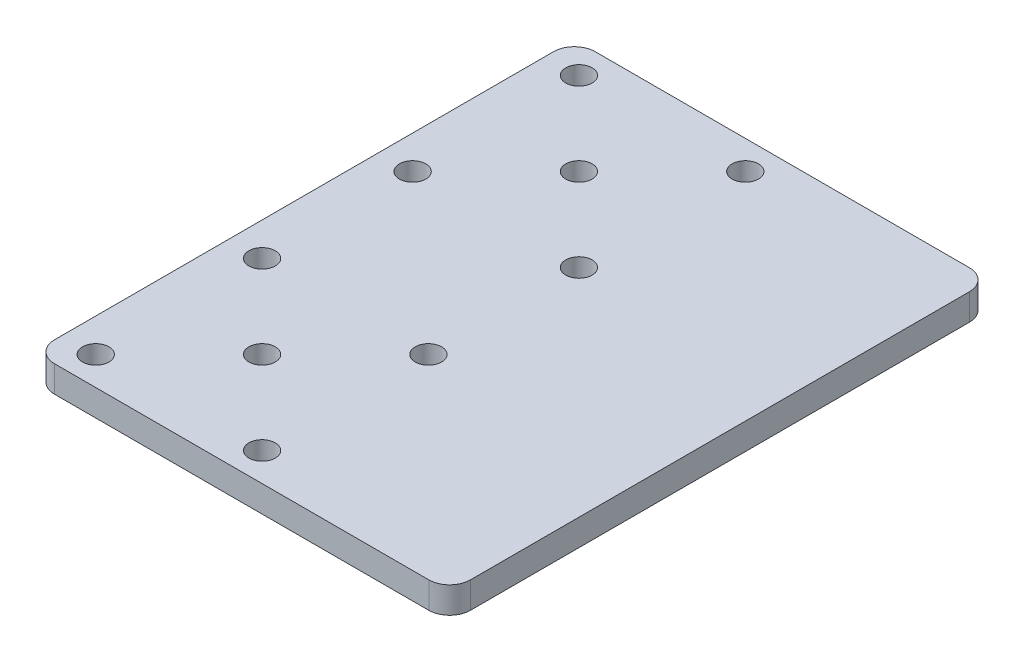
ISO-10303-21;
HEADER;
FILE_DESCRIPTION(('STEP AP214'),'2;1');
FILE_NAME('part.step','',(''),(''),'','','');
FILE_SCHEMA(('AUTOMOTIVE_DESIGN { 1 0 10303 214 1 1 1 1 }'));
ENDSEC;
DATA;
#1=APPLICATION_CONTEXT('core data for automotive mechanical design processes');
#2=APPLICATION_PROTOCOL_DEFINITION('international standard','automotive_design',2000,#1);
#3=PRODUCT_CONTEXT('',#1,'mechanical');
#4=PRODUCT('Part','Part','',(#3));
#5=PRODUCT_RELATED_PRODUCT_CATEGORY('part','',(#4));
#6=PRODUCT_DEFINITION_FORMATION('','',#4);
#7=PRODUCT_DEFINITION_CONTEXT('part definition',#1,'design');
#8=PRODUCT_DEFINITION('design','',#6,#7);
#9=PRODUCT_DEFINITION_SHAPE('','',#8);
#10=(LENGTH_UNIT() NAMED_UNIT(*) SI_UNIT(.MILLI.,.METRE.));
#11=(NAMED_UNIT(*) PLANE_ANGLE_UNIT() SI_UNIT($,.RADIAN.));
#12=(NAMED_UNIT(*) SI_UNIT($,.STERADIAN.) SOLID_ANGLE_UNIT());
#13=UNCERTAINTY_MEASURE_WITH_UNIT(LENGTH_MEASURE(1.E-05),#10,'distance_accuracy_value','');
#14=(GEOMETRIC_REPRESENTATION_CONTEXT(3) GLOBAL_UNCERTAINTY_ASSIGNED_CONTEXT((#13)) GLOBAL_UNIT_ASSIGNED_CONTEXT((#10,
#11,#12)) REPRESENTATION_CONTEXT('',''));
#15=CARTESIAN_POINT('',(0.,0.,0.));
#16=DIRECTION('',(0.,0.,1.));
#17=DIRECTION('',(1.,0.,0.));
#18=AXIS2_PLACEMENT_3D('',#15,#16,#17);
#19=CARTESIAN_POINT('',(-50.,6.35,65.));
#20=DIRECTION('',(0.,0.,-1.));
#21=DIRECTION('',(-1.,0.,0.));
#22=AXIS2_PLACEMENT_3D('',#19,#20,#21);
#23=PLANE('',#22);
#24=DIRECTION('',(1.,0.,0.));
#25=VECTOR('',#24,1.);
#26=CARTESIAN_POINT('',(-50.,6.35,65.));
#27=LINE('',#26,#25);
#28=CARTESIAN_POINT('',(-45.,6.35,65.));
#29=VERTEX_POINT('',#28);
#30=CARTESIAN_POINT('',(45.,6.35,65.));
#31=VERTEX_POINT('',#30);
#32=EDGE_CURVE('E128',#29,#31,#27,.T.);
#33=ORIENTED_EDGE('',*,*,#32,.F.);
#34=DIRECTION('',(0.,-1.,0.));
#35=VECTOR('',#34,1.);
#36=CARTESIAN_POINT('',(-45.,6.35,65.));
#37=LINE('',#36,#35);
#38=CARTESIAN_POINT('',(-45.,0.,65.));
#39=VERTEX_POINT('',#38);
#40=EDGE_CURVE('E11',#29,#39,#37,.T.);
#41=ORIENTED_EDGE('',*,*,#40,.T.);
#42=DIRECTION('',(1.,0.,0.));
#43=VECTOR('',#42,1.);
#44=CARTESIAN_POINT('',(-50.,0.,65.));
#45=LINE('',#44,#43);
#46=CARTESIAN_POINT('',(45.,0.,65.));
#47=VERTEX_POINT('',#46);
#48=EDGE_CURVE('E130',#39,#47,#45,.T.);
#49=ORIENTED_EDGE('',*,*,#48,.T.);
#50=DIRECTION('',(0.,-1.,0.));
#51=VECTOR('',#50,1.);
#52=CARTESIAN_POINT('',(45.,6.35,65.));
#53=LINE('',#52,#51);
#54=EDGE_CURVE('E41',#47,#31,#53,.F.);
#55=ORIENTED_EDGE('',*,*,#54,.T.);
#56=EDGE_LOOP('',(#33,#41,#49,#55));
#57=FACE_BOUND('',#56,.T.);
#58=ADVANCED_FACE('F33',(#57),#23,.F.);
#59=CARTESIAN_POINT('',(50.,6.35,65.));
#60=DIRECTION('',(-1.,0.,0.));
#61=DIRECTION('',(0.,0.,1.));
#62=AXIS2_PLACEMENT_3D('',#59,#60,#61);
#63=PLANE('',#62);
#64=DIRECTION('',(0.,0.,-1.));
#65=VECTOR('',#64,1.);
#66=CARTESIAN_POINT('',(50.,0.,65.));
#67=LINE('',#66,#65);
#68=CARTESIAN_POINT('',(50.,0.,60.));
#69=VERTEX_POINT('',#68);
#70=CARTESIAN_POINT('',(50.,0.,-60.));
#71=VERTEX_POINT('',#70);
#72=EDGE_CURVE('E126',#69,#71,#67,.T.);
#73=ORIENTED_EDGE('',*,*,#72,.T.);
#74=DIRECTION('',(0.,-1.,0.));
#75=VECTOR('',#74,1.);
#76=CARTESIAN_POINT('',(50.,6.35,-60.));
#77=LINE('',#76,#75);
#78=CARTESIAN_POINT('',(50.,6.35,-60.));
#79=VERTEX_POINT('',#78);
#80=EDGE_CURVE('E105',#71,#79,#77,.F.);
#81=ORIENTED_EDGE('',*,*,#80,.T.);
#82=DIRECTION('',(0.,0.,-1.));
#83=VECTOR('',#82,1.);
#84=CARTESIAN_POINT('',(50.,6.35,65.));
#85=LINE('',#84,#83);
#86=CARTESIAN_POINT('',(50.,6.35,60.));
#87=VERTEX_POINT('',#86);
#88=EDGE_CURVE('E166',#87,#79,#85,.T.);
#89=ORIENTED_EDGE('',*,*,#88,.F.);
#90=DIRECTION('',(0.,-1.,0.));
#91=VECTOR('',#90,1.);
#92=CARTESIAN_POINT('',(50.,6.35,60.));
#93=LINE('',#92,#91);
#94=EDGE_CURVE('E110',#87,#69,#93,.T.);
#95=ORIENTED_EDGE('',*,*,#94,.T.);
#96=EDGE_LOOP('',(#73,#81,#89,#95));
#97=FACE_BOUND('',#96,.T.);
#98=ADVANCED_FACE('F170',(#97),#63,.F.);
#99=CARTESIAN_POINT('',(-50.,6.35,-65.));
#100=DIRECTION('',(0.,0.,1.));
#101=DIRECTION('',(1.,0.,0.));
#102=AXIS2_PLACEMENT_3D('',#99,#100,#101);
#103=PLANE('',#102);
#104=DIRECTION('',(-1.,0.,0.));
#105=VECTOR('',#104,1.);
#106=CARTESIAN_POINT('',(-50.,6.35,-65.));
#107=LINE('',#106,#105);
#108=CARTESIAN_POINT('',(45.,6.35,-65.));
#109=VERTEX_POINT('',#108);
#110=CARTESIAN_POINT('',(-45.,6.35,-65.));
#111=VERTEX_POINT('',#110);
#112=EDGE_CURVE('E119',#109,#111,#107,.T.);
#113=ORIENTED_EDGE('',*,*,#112,.F.);
#114=DIRECTION('',(0.,-1.,0.));
#115=VECTOR('',#114,1.);
#116=CARTESIAN_POINT('',(45.,6.35,-65.));
#117=LINE('',#116,#115);
#118=CARTESIAN_POINT('',(45.,0.,-65.));
#119=VERTEX_POINT('',#118);
#120=EDGE_CURVE('E104',#109,#119,#117,.T.);
#121=ORIENTED_EDGE('',*,*,#120,.T.);
#122=DIRECTION('',(-1.,0.,0.));
#123=VECTOR('',#122,1.);
#124=CARTESIAN_POINT('',(-50.,0.,-65.));
#125=LINE('',#124,#123);
#126=CARTESIAN_POINT('',(-45.,0.,-65.));
#127=VERTEX_POINT('',#126);
#128=EDGE_CURVE('E117',#119,#127,#125,.T.);
#129=ORIENTED_EDGE('',*,*,#128,.T.);
#130=DIRECTION('',(0.,-1.,0.));
#131=VECTOR('',#130,1.);
#132=CARTESIAN_POINT('',(-45.,6.35,-65.));
#133=LINE('',#132,#131);
#134=EDGE_CURVE('E121',#127,#111,#133,.F.);
#135=ORIENTED_EDGE('',*,*,#134,.T.);
#136=EDGE_LOOP('',(#113,#121,#129,#135));
#137=FACE_BOUND('',#136,.T.);
#138=ADVANCED_FACE('F116',(#137),#103,.F.);
#139=CARTESIAN_POINT('',(-50.,6.35,65.));
#140=DIRECTION('',(1.,0.,0.));
#141=DIRECTION('',(0.,0.,-1.));
#142=AXIS2_PLACEMENT_3D('',#139,#140,#141);
#143=PLANE('',#142);
#144=DIRECTION('',(0.,0.,1.));
#145=VECTOR('',#144,1.);
#146=CARTESIAN_POINT('',(-50.,6.35,65.));
#147=LINE('',#146,#145);
#148=CARTESIAN_POINT('',(-50.,6.35,-60.));
#149=VERTEX_POINT('',#148);
#150=CARTESIAN_POINT('',(-50.,6.35,60.));
#151=VERTEX_POINT('',#150);
#152=EDGE_CURVE('E134',#149,#151,#147,.T.);
#153=ORIENTED_EDGE('',*,*,#152,.F.);
#154=DIRECTION('',(0.,-1.,0.));
#155=VECTOR('',#154,1.);
#156=CARTESIAN_POINT('',(-50.,6.35,-60.));
#157=LINE('',#156,#155);
#158=CARTESIAN_POINT('',(-50.,0.,-60.));
#159=VERTEX_POINT('',#158);
#160=EDGE_CURVE('E151',#149,#159,#157,.T.);
#161=ORIENTED_EDGE('',*,*,#160,.T.);
#162=DIRECTION('',(0.,0.,1.));
#163=VECTOR('',#162,1.);
#164=CARTESIAN_POINT('',(-50.,0.,65.));
#165=LINE('',#164,#163);
#166=CARTESIAN_POINT('',(-50.,0.,60.));
#167=VERTEX_POINT('',#166);
#168=EDGE_CURVE('E125',#159,#167,#165,.T.);
#169=ORIENTED_EDGE('',*,*,#168,.T.);
#170=DIRECTION('',(0.,-1.,0.));
#171=VECTOR('',#170,1.);
#172=CARTESIAN_POINT('',(-50.,6.35,60.));
#173=LINE('',#172,#171);
#174=EDGE_CURVE('E48',#167,#151,#173,.F.);
#175=ORIENTED_EDGE('',*,*,#174,.T.);
#176=EDGE_LOOP('',(#153,#161,#169,#175));
#177=FACE_BOUND('',#176,.T.);
#178=ADVANCED_FACE('F240',(#177),#143,.F.);
#179=CARTESIAN_POINT('',(0.,6.35,0.));
#180=DIRECTION('',(0.,1.,0.));
#181=DIRECTION('',(0.,0.,1.));
#182=AXIS2_PLACEMENT_3D('',#179,#180,#181);
#183=PLANE('',#182);
#184=CARTESIAN_POINT('',(-42.,6.35,-18.1));
#185=DIRECTION('',(0.,1.,0.));
#186=DIRECTION('',(0.,0.,1.));
#187=AXIS2_PLACEMENT_3D('',#184,#185,#186);
#188=CIRCLE('',#187,3.175);
#189=CARTESIAN_POINT('',(-42.,6.35,-14.925));
#190=VERTEX_POINT('',#189);
#191=EDGE_CURVE('E232',#190,#190,#188,.T.);
#192=ORIENTED_EDGE('',*,*,#191,.F.);
#193=EDGE_LOOP('',(#192));
#194=FACE_BOUND('',#193,.T.);
#195=CARTESIAN_POINT('',(-2.00000000000002,6.35,-18.1));
#196=DIRECTION('',(0.,1.,0.));
#197=DIRECTION('',(0.,0.,1.));
#198=AXIS2_PLACEMENT_3D('',#195,#196,#197);
#199=CIRCLE('',#198,3.175);
#200=CARTESIAN_POINT('',(-2.00000000000002,6.35,-14.925));
#201=VERTEX_POINT('',#200);
#202=EDGE_CURVE('E226',#201,#201,#199,.T.);
#203=ORIENTED_EDGE('',*,*,#202,.F.);
#204=EDGE_LOOP('',(#203));
#205=FACE_BOUND('',#204,.T.);
#206=CARTESIAN_POINT('',(-2.00000000000002,6.35,-58.1));
#207=DIRECTION('',(0.,1.,0.));
#208=DIRECTION('',(0.,0.,1.));
#209=AXIS2_PLACEMENT_3D('',#206,#207,#208);
#210=CIRCLE('',#209,3.175);
#211=CARTESIAN_POINT('',(-2.00000000000002,6.35,-54.925));
#212=VERTEX_POINT('',#211);
#213=EDGE_CURVE('E220',#212,#212,#210,.T.);
#214=ORIENTED_EDGE('',*,*,#213,.F.);
#215=EDGE_LOOP('',(#214));
#216=FACE_BOUND('',#215,.T.);
#217=CARTESIAN_POINT('',(-42.,6.35,-58.1));
#218=DIRECTION('',(0.,1.,0.));
#219=DIRECTION('',(0.,0.,1.));
#220=AXIS2_PLACEMENT_3D('',#217,#218,#219);
#221=CIRCLE('',#220,3.175);
#222=CARTESIAN_POINT('',(-42.,6.35,-54.925));
#223=VERTEX_POINT('',#222);
#224=EDGE_CURVE('E214',#223,#223,#221,.T.);
#225=ORIENTED_EDGE('',*,*,#224,.F.);
#226=EDGE_LOOP('',(#225));
#227=FACE_BOUND('',#226,.T.);
#228=CARTESIAN_POINT('',(-22.,6.35,-38.1));
#229=DIRECTION('',(0.,1.,0.));
#230=DIRECTION('',(0.,0.,1.));
#231=AXIS2_PLACEMENT_3D('',#228,#229,#230);
#232=CIRCLE('',#231,3.175);
#233=CARTESIAN_POINT('',(-22.,6.35,-34.925));
#234=VERTEX_POINT('',#233);
#235=EDGE_CURVE('E208',#234,#234,#232,.T.);
#236=ORIENTED_EDGE('',*,*,#235,.F.);
#237=EDGE_LOOP('',(#236));
#238=FACE_BOUND('',#237,.T.);
#239=CARTESIAN_POINT('',(-42.,6.35,18.1));
#240=DIRECTION('',(0.,1.,0.));
#241=DIRECTION('',(0.,0.,1.));
#242=AXIS2_PLACEMENT_3D('',#239,#240,#241);
#243=CIRCLE('',#242,3.175);
#244=CARTESIAN_POINT('',(-42.,6.35,21.275));
#245=VERTEX_POINT('',#244);
#246=EDGE_CURVE('E202',#245,#245,#243,.T.);
#247=ORIENTED_EDGE('',*,*,#246,.F.);
#248=EDGE_LOOP('',(#247));
#249=FACE_BOUND('',#248,.T.);
#250=CARTESIAN_POINT('',(-2.00000000000002,6.35,18.1));
#251=DIRECTION('',(0.,1.,0.));
#252=DIRECTION('',(0.,0.,1.));
#253=AXIS2_PLACEMENT_3D('',#250,#251,#252);
#254=CIRCLE('',#253,3.175);
#255=CARTESIAN_POINT('',(-2.00000000000002,6.35,21.275));
#256=VERTEX_POINT('',#255);
#257=EDGE_CURVE('E196',#256,#256,#254,.T.);
#258=ORIENTED_EDGE('',*,*,#257,.F.);
#259=EDGE_LOOP('',(#258));
#260=FACE_BOUND('',#259,.T.);
#261=CARTESIAN_POINT('',(-2.00000000000002,6.35,58.1));
#262=DIRECTION('',(0.,1.,0.));
#263=DIRECTION('',(0.,0.,1.));
#264=AXIS2_PLACEMENT_3D('',#261,#262,#263);
#265=CIRCLE('',#264,3.175);
#266=CARTESIAN_POINT('',(-2.00000000000002,6.35,61.275));
#267=VERTEX_POINT('',#266);
#268=EDGE_CURVE('E190',#267,#267,#265,.T.);
#269=ORIENTED_EDGE('',*,*,#268,.F.);
#270=EDGE_LOOP('',(#269));
#271=FACE_BOUND('',#270,.T.);
#272=CARTESIAN_POINT('',(-42.,6.35,58.1));
#273=DIRECTION('',(0.,1.,0.));
#274=DIRECTION('',(0.,0.,1.));
#275=AXIS2_PLACEMENT_3D('',#272,#273,#274);
#276=CIRCLE('',#275,3.175);
#277=CARTESIAN_POINT('',(-42.,6.35,61.275));
#278=VERTEX_POINT('',#277);
#279=EDGE_CURVE('E184',#278,#278,#276,.T.);
#280=ORIENTED_EDGE('',*,*,#279,.F.);
#281=EDGE_LOOP('',(#280));
#282=FACE_BOUND('',#281,.T.);
#283=CARTESIAN_POINT('',(-22.,6.35,38.1));
#284=DIRECTION('',(0.,1.,0.));
#285=DIRECTION('',(0.,0.,1.));
#286=AXIS2_PLACEMENT_3D('',#283,#284,#285);
#287=CIRCLE('',#286,3.175);
#288=CARTESIAN_POINT('',(-22.,6.35,41.275));
#289=VERTEX_POINT('',#288);
#290=EDGE_CURVE('E173',#289,#289,#287,.T.);
#291=ORIENTED_EDGE('',*,*,#290,.F.);
#292=EDGE_LOOP('',(#291));
#293=FACE_BOUND('',#292,.T.);
#294=ORIENTED_EDGE('',*,*,#88,.T.);
#295=CARTESIAN_POINT('',(45.,6.35,-60.));
#296=DIRECTION('',(0.,1.,0.));
#297=DIRECTION('',(0.,0.,1.));
#298=AXIS2_PLACEMENT_3D('',#295,#296,#297);
#299=CIRCLE('',#298,5.);
#300=EDGE_CURVE('E148',#79,#109,#299,.T.);
#301=ORIENTED_EDGE('',*,*,#300,.T.);
#302=ORIENTED_EDGE('',*,*,#112,.T.);
#303=CARTESIAN_POINT('',(-45.,6.35,-60.));
#304=DIRECTION('',(0.,1.,0.));
#305=DIRECTION('',(0.,0.,1.));
#306=AXIS2_PLACEMENT_3D('',#303,#304,#305);
#307=CIRCLE('',#306,5.);
#308=EDGE_CURVE('E55',#111,#149,#307,.T.);
#309=ORIENTED_EDGE('',*,*,#308,.T.);
#310=ORIENTED_EDGE('',*,*,#152,.T.);
#311=CARTESIAN_POINT('',(-45.,6.35,60.));
#312=DIRECTION('',(0.,1.,0.));
#313=DIRECTION('',(0.,0.,1.));
#314=AXIS2_PLACEMENT_3D('',#311,#312,#313);
#315=CIRCLE('',#314,5.);
#316=EDGE_CURVE('E145',#151,#29,#315,.T.);
#317=ORIENTED_EDGE('',*,*,#316,.T.);
#318=ORIENTED_EDGE('',*,*,#32,.T.);
#319=CARTESIAN_POINT('',(45.,6.35,60.));
#320=DIRECTION('',(0.,1.,0.));
#321=DIRECTION('',(0.,0.,1.));
#322=AXIS2_PLACEMENT_3D('',#319,#320,#321);
#323=CIRCLE('',#322,5.);
#324=EDGE_CURVE('E143',#31,#87,#323,.T.);
#325=ORIENTED_EDGE('',*,*,#324,.T.);
#326=EDGE_LOOP('',(#294,#301,#302,#309,#310,#317,#318,#325));
#327=FACE_BOUND('',#326,.T.);
#328=ADVANCED_FACE('F163',(#194,#205,#216,#227,#238,#249,#260,#271,#282,#293,#327),#183,.T.);
#329=CARTESIAN_POINT('',(0.,0.,0.));
#330=DIRECTION('',(0.,1.,0.));
#331=DIRECTION('',(0.,0.,1.));
#332=AXIS2_PLACEMENT_3D('',#329,#330,#331);
#333=PLANE('',#332);
#334=CARTESIAN_POINT('',(-42.,0.,-18.1));
#335=DIRECTION('',(0.,1.,0.));
#336=DIRECTION('',(0.,0.,1.));
#337=AXIS2_PLACEMENT_3D('',#334,#335,#336);
#338=CIRCLE('',#337,3.175);
#339=CARTESIAN_POINT('',(-42.,0.,-14.925));
#340=VERTEX_POINT('',#339);
#341=EDGE_CURVE('E229',#340,#340,#338,.T.);
#342=ORIENTED_EDGE('',*,*,#341,.T.);
#343=EDGE_LOOP('',(#342));
#344=FACE_BOUND('',#343,.T.);
#345=CARTESIAN_POINT('',(-2.00000000000002,0.,-18.1));
#346=DIRECTION('',(0.,1.,0.));
#347=DIRECTION('',(0.,0.,1.));
#348=AXIS2_PLACEMENT_3D('',#345,#346,#347);
#349=CIRCLE('',#348,3.175);
#350=CARTESIAN_POINT('',(-2.00000000000002,0.,-14.925));
#351=VERTEX_POINT('',#350);
#352=EDGE_CURVE('E223',#351,#351,#349,.T.);
#353=ORIENTED_EDGE('',*,*,#352,.T.);
#354=EDGE_LOOP('',(#353));
#355=FACE_BOUND('',#354,.T.);
#356=CARTESIAN_POINT('',(-2.00000000000002,0.,-58.1));
#357=DIRECTION('',(0.,1.,0.));
#358=DIRECTION('',(0.,0.,1.));
#359=AXIS2_PLACEMENT_3D('',#356,#357,#358);
#360=CIRCLE('',#359,3.175);
#361=CARTESIAN_POINT('',(-2.00000000000002,0.,-54.925));
#362=VERTEX_POINT('',#361);
#363=EDGE_CURVE('E217',#362,#362,#360,.T.);
#364=ORIENTED_EDGE('',*,*,#363,.T.);
#365=EDGE_LOOP('',(#364));
#366=FACE_BOUND('',#365,.T.);
#367=CARTESIAN_POINT('',(-42.,0.,-58.1));
#368=DIRECTION('',(0.,1.,0.));
#369=DIRECTION('',(0.,0.,1.));
#370=AXIS2_PLACEMENT_3D('',#367,#368,#369);
#371=CIRCLE('',#370,3.175);
#372=CARTESIAN_POINT('',(-42.,0.,-54.925));
#373=VERTEX_POINT('',#372);
#374=EDGE_CURVE('E211',#373,#373,#371,.T.);
#375=ORIENTED_EDGE('',*,*,#374,.T.);
#376=EDGE_LOOP('',(#375));
#377=FACE_BOUND('',#376,.T.);
#378=CARTESIAN_POINT('',(-22.,0.,-38.1));
#379=DIRECTION('',(0.,1.,0.));
#380=DIRECTION('',(0.,0.,1.));
#381=AXIS2_PLACEMENT_3D('',#378,#379,#380);
#382=CIRCLE('',#381,3.175);
#383=CARTESIAN_POINT('',(-22.,0.,-34.925));
#384=VERTEX_POINT('',#383);
#385=EDGE_CURVE('E205',#384,#384,#382,.T.);
#386=ORIENTED_EDGE('',*,*,#385,.T.);
#387=EDGE_LOOP('',(#386));
#388=FACE_BOUND('',#387,.T.);
#389=CARTESIAN_POINT('',(-42.,0.,18.1));
#390=DIRECTION('',(0.,1.,0.));
#391=DIRECTION('',(0.,0.,1.));
#392=AXIS2_PLACEMENT_3D('',#389,#390,#391);
#393=CIRCLE('',#392,3.175);
#394=CARTESIAN_POINT('',(-42.,0.,21.275));
#395=VERTEX_POINT('',#394);
#396=EDGE_CURVE('E199',#395,#395,#393,.T.);
#397=ORIENTED_EDGE('',*,*,#396,.T.);
#398=EDGE_LOOP('',(#397));
#399=FACE_BOUND('',#398,.T.);
#400=CARTESIAN_POINT('',(-2.00000000000002,0.,18.1));
#401=DIRECTION('',(0.,1.,0.));
#402=DIRECTION('',(0.,0.,1.));
#403=AXIS2_PLACEMENT_3D('',#400,#401,#402);
#404=CIRCLE('',#403,3.175);
#405=CARTESIAN_POINT('',(-2.00000000000002,0.,21.275));
#406=VERTEX_POINT('',#405);
#407=EDGE_CURVE('E193',#406,#406,#404,.T.);
#408=ORIENTED_EDGE('',*,*,#407,.T.);
#409=EDGE_LOOP('',(#408));
#410=FACE_BOUND('',#409,.T.);
#411=CARTESIAN_POINT('',(-2.00000000000002,0.,58.1));
#412=DIRECTION('',(0.,1.,0.));
#413=DIRECTION('',(0.,0.,1.));
#414=AXIS2_PLACEMENT_3D('',#411,#412,#413);
#415=CIRCLE('',#414,3.175);
#416=CARTESIAN_POINT('',(-2.00000000000002,0.,61.275));
#417=VERTEX_POINT('',#416);
#418=EDGE_CURVE('E187',#417,#417,#415,.T.);
#419=ORIENTED_EDGE('',*,*,#418,.T.);
#420=EDGE_LOOP('',(#419));
#421=FACE_BOUND('',#420,.T.);
#422=CARTESIAN_POINT('',(-42.,0.,58.1));
#423=DIRECTION('',(0.,1.,0.));
#424=DIRECTION('',(0.,0.,1.));
#425=AXIS2_PLACEMENT_3D('',#422,#423,#424);
#426=CIRCLE('',#425,3.175);
#427=CARTESIAN_POINT('',(-42.,0.,61.275));
#428=VERTEX_POINT('',#427);
#429=EDGE_CURVE('E181',#428,#428,#426,.T.);
#430=ORIENTED_EDGE('',*,*,#429,.T.);
#431=EDGE_LOOP('',(#430));
#432=FACE_BOUND('',#431,.T.);
#433=CARTESIAN_POINT('',(-22.,0.,38.1));
#434=DIRECTION('',(0.,1.,0.));
#435=DIRECTION('',(0.,0.,1.));
#436=AXIS2_PLACEMENT_3D('',#433,#434,#435);
#437=CIRCLE('',#436,3.175);
#438=CARTESIAN_POINT('',(-22.,0.,41.275));
#439=VERTEX_POINT('',#438);
#440=EDGE_CURVE('E171',#439,#439,#437,.T.);
#441=ORIENTED_EDGE('',*,*,#440,.T.);
#442=EDGE_LOOP('',(#441));
#443=FACE_BOUND('',#442,.T.);
#444=ORIENTED_EDGE('',*,*,#128,.F.);
#445=CARTESIAN_POINT('',(45.,0.,-60.));
#446=DIRECTION('',(0.,1.,0.));
#447=DIRECTION('',(0.,0.,1.));
#448=AXIS2_PLACEMENT_3D('',#445,#446,#447);
#449=CIRCLE('',#448,5.);
#450=EDGE_CURVE('E100',#119,#71,#449,.F.);
#451=ORIENTED_EDGE('',*,*,#450,.T.);
#452=ORIENTED_EDGE('',*,*,#72,.F.);
#453=CARTESIAN_POINT('',(45.,0.,60.));
#454=DIRECTION('',(0.,1.,0.));
#455=DIRECTION('',(0.,0.,1.));
#456=AXIS2_PLACEMENT_3D('',#453,#454,#455);
#457=CIRCLE('',#456,5.);
#458=EDGE_CURVE('E120',#69,#47,#457,.F.);
#459=ORIENTED_EDGE('',*,*,#458,.T.);
#460=ORIENTED_EDGE('',*,*,#48,.F.);
#461=CARTESIAN_POINT('',(-45.,0.,60.));
#462=DIRECTION('',(0.,1.,0.));
#463=DIRECTION('',(0.,0.,1.));
#464=AXIS2_PLACEMENT_3D('',#461,#462,#463);
#465=CIRCLE('',#464,5.);
#466=EDGE_CURVE('E137',#39,#167,#465,.F.);
#467=ORIENTED_EDGE('',*,*,#466,.T.);
#468=ORIENTED_EDGE('',*,*,#168,.F.);
#469=CARTESIAN_POINT('',(-45.,0.,-60.));
#470=DIRECTION('',(0.,1.,0.));
#471=DIRECTION('',(0.,0.,1.));
#472=AXIS2_PLACEMENT_3D('',#469,#470,#471);
#473=CIRCLE('',#472,5.);
#474=EDGE_CURVE('E111',#159,#127,#473,.F.);
#475=ORIENTED_EDGE('',*,*,#474,.T.);
#476=EDGE_LOOP('',(#444,#451,#452,#459,#460,#467,#468,#475));
#477=FACE_BOUND('',#476,.T.);
#478=ADVANCED_FACE('F123',(#344,#355,#366,#377,#388,#399,#410,#421,#432,#443,#477),#333,.F.);
#479=CARTESIAN_POINT('',(45.,6.35,-60.));
#480=DIRECTION('',(0.,-1.,0.));
#481=DIRECTION('',(0.,0.,-1.));
#482=AXIS2_PLACEMENT_3D('',#479,#480,#481);
#483=CYLINDRICAL_SURFACE('',#482,5.);
#484=ORIENTED_EDGE('',*,*,#300,.F.);
#485=ORIENTED_EDGE('',*,*,#80,.F.);
#486=ORIENTED_EDGE('',*,*,#450,.F.);
#487=ORIENTED_EDGE('',*,*,#120,.F.);
#488=EDGE_LOOP('',(#484,#485,#486,#487));
#489=FACE_BOUND('',#488,.T.);
#490=ADVANCED_FACE('F103',(#489),#483,.T.);
#491=CARTESIAN_POINT('',(-45.,6.35,-60.));
#492=DIRECTION('',(0.,-1.,0.));
#493=DIRECTION('',(0.,0.,-1.));
#494=AXIS2_PLACEMENT_3D('',#491,#492,#493);
#495=CYLINDRICAL_SURFACE('',#494,5.);
#496=ORIENTED_EDGE('',*,*,#308,.F.);
#497=ORIENTED_EDGE('',*,*,#134,.F.);
#498=ORIENTED_EDGE('',*,*,#474,.F.);
#499=ORIENTED_EDGE('',*,*,#160,.F.);
#500=EDGE_LOOP('',(#496,#497,#498,#499));
#501=FACE_BOUND('',#500,.T.);
#502=ADVANCED_FACE('F284',(#501),#495,.T.);
#503=CARTESIAN_POINT('',(-45.,6.35,60.));
#504=DIRECTION('',(0.,-1.,0.));
#505=DIRECTION('',(0.,0.,-1.));
#506=AXIS2_PLACEMENT_3D('',#503,#504,#505);
#507=CYLINDRICAL_SURFACE('',#506,5.);
#508=ORIENTED_EDGE('',*,*,#316,.F.);
#509=ORIENTED_EDGE('',*,*,#174,.F.);
#510=ORIENTED_EDGE('',*,*,#466,.F.);
#511=ORIENTED_EDGE('',*,*,#40,.F.);
#512=EDGE_LOOP('',(#508,#509,#510,#511));
#513=FACE_BOUND('',#512,.T.);
#514=ADVANCED_FACE('F272',(#513),#507,.T.);
#515=CARTESIAN_POINT('',(45.,6.35,60.));
#516=DIRECTION('',(0.,-1.,0.));
#517=DIRECTION('',(0.,0.,-1.));
#518=AXIS2_PLACEMENT_3D('',#515,#516,#517);
#519=CYLINDRICAL_SURFACE('',#518,5.);
#520=ORIENTED_EDGE('',*,*,#324,.F.);
#521=ORIENTED_EDGE('',*,*,#54,.F.);
#522=ORIENTED_EDGE('',*,*,#458,.F.);
#523=ORIENTED_EDGE('',*,*,#94,.F.);
#524=EDGE_LOOP('',(#520,#521,#522,#523));
#525=FACE_BOUND('',#524,.T.);
#526=ADVANCED_FACE('F35',(#525),#519,.T.);
#527=CARTESIAN_POINT('',(-22.,6.35,38.1));
#528=DIRECTION('',(0.,1.,0.));
#529=DIRECTION('',(0.,0.,1.));
#530=AXIS2_PLACEMENT_3D('',#527,#528,#529);
#531=CYLINDRICAL_SURFACE('',#530,3.175);
#532=ORIENTED_EDGE('',*,*,#440,.F.);
#533=EDGE_LOOP('',(#532));
#534=FACE_BOUND('',#533,.T.);
#535=ORIENTED_EDGE('',*,*,#290,.T.);
#536=EDGE_LOOP('',(#535));
#537=FACE_BOUND('',#536,.T.);
#538=ADVANCED_FACE('F260',(#534,#537),#531,.F.);
#539=CARTESIAN_POINT('',(-42.,6.35,58.1));
#540=DIRECTION('',(0.,1.,0.));
#541=DIRECTION('',(0.,0.,1.));
#542=AXIS2_PLACEMENT_3D('',#539,#540,#541);
#543=CYLINDRICAL_SURFACE('',#542,3.175);
#544=ORIENTED_EDGE('',*,*,#429,.F.);
#545=EDGE_LOOP('',(#544));
#546=FACE_BOUND('',#545,.T.);
#547=ORIENTED_EDGE('',*,*,#279,.T.);
#548=EDGE_LOOP('',(#547));
#549=FACE_BOUND('',#548,.T.);
#550=ADVANCED_FACE('F262',(#546,#549),#543,.F.);
#551=CARTESIAN_POINT('',(-2.00000000000002,6.35,58.1));
#552=DIRECTION('',(0.,1.,0.));
#553=DIRECTION('',(0.,0.,1.));
#554=AXIS2_PLACEMENT_3D('',#551,#552,#553);
#555=CYLINDRICAL_SURFACE('',#554,3.175);
#556=ORIENTED_EDGE('',*,*,#418,.F.);
#557=EDGE_LOOP('',(#556));
#558=FACE_BOUND('',#557,.T.);
#559=ORIENTED_EDGE('',*,*,#268,.T.);
#560=EDGE_LOOP('',(#559));
#561=FACE_BOUND('',#560,.T.);
#562=ADVANCED_FACE('F269',(#558,#561),#555,.F.);
#563=CARTESIAN_POINT('',(-2.00000000000002,6.35,18.1));
#564=DIRECTION('',(0.,1.,0.));
#565=DIRECTION('',(0.,0.,1.));
#566=AXIS2_PLACEMENT_3D('',#563,#564,#565);
#567=CYLINDRICAL_SURFACE('',#566,3.175);
#568=ORIENTED_EDGE('',*,*,#407,.F.);
#569=EDGE_LOOP('',(#568));
#570=FACE_BOUND('',#569,.T.);
#571=ORIENTED_EDGE('',*,*,#257,.T.);
#572=EDGE_LOOP('',(#571));
#573=FACE_BOUND('',#572,.T.);
#574=ADVANCED_FACE('F316',(#570,#573),#567,.F.);
#575=CARTESIAN_POINT('',(-42.,6.35,18.1));
#576=DIRECTION('',(0.,1.,0.));
#577=DIRECTION('',(0.,0.,1.));
#578=AXIS2_PLACEMENT_3D('',#575,#576,#577);
#579=CYLINDRICAL_SURFACE('',#578,3.175);
#580=ORIENTED_EDGE('',*,*,#396,.F.);
#581=EDGE_LOOP('',(#580));
#582=FACE_BOUND('',#581,.T.);
#583=ORIENTED_EDGE('',*,*,#246,.T.);
#584=EDGE_LOOP('',(#583));
#585=FACE_BOUND('',#584,.T.);
#586=ADVANCED_FACE('F326',(#582,#585),#579,.F.);
#587=CARTESIAN_POINT('',(-22.,6.35,-38.1));
#588=DIRECTION('',(0.,1.,0.));
#589=DIRECTION('',(0.,0.,1.));
#590=AXIS2_PLACEMENT_3D('',#587,#588,#589);
#591=CYLINDRICAL_SURFACE('',#590,3.175);
#592=ORIENTED_EDGE('',*,*,#385,.F.);
#593=EDGE_LOOP('',(#592));
#594=FACE_BOUND('',#593,.T.);
#595=ORIENTED_EDGE('',*,*,#235,.T.);
#596=EDGE_LOOP('',(#595));
#597=FACE_BOUND('',#596,.T.);
#598=ADVANCED_FACE('F336',(#594,#597),#591,.F.);
#599=CARTESIAN_POINT('',(-42.,6.35,-58.1));
#600=DIRECTION('',(0.,1.,0.));
#601=DIRECTION('',(0.,0.,1.));
#602=AXIS2_PLACEMENT_3D('',#599,#600,#601);
#603=CYLINDRICAL_SURFACE('',#602,3.175);
#604=ORIENTED_EDGE('',*,*,#374,.F.);
#605=EDGE_LOOP('',(#604));
#606=FACE_BOUND('',#605,.T.);
#607=ORIENTED_EDGE('',*,*,#224,.T.);
#608=EDGE_LOOP('',(#607));
#609=FACE_BOUND('',#608,.T.);
#610=ADVANCED_FACE('F364',(#606,#609),#603,.F.);
#611=CARTESIAN_POINT('',(-2.00000000000002,6.35,-58.1));
#612=DIRECTION('',(0.,1.,0.));
#613=DIRECTION('',(0.,0.,1.));
#614=AXIS2_PLACEMENT_3D('',#611,#612,#613);
#615=CYLINDRICAL_SURFACE('',#614,3.175);
#616=ORIENTED_EDGE('',*,*,#363,.F.);
#617=EDGE_LOOP('',(#616));
#618=FACE_BOUND('',#617,.T.);
#619=ORIENTED_EDGE('',*,*,#213,.T.);
#620=EDGE_LOOP('',(#619));
#621=FACE_BOUND('',#620,.T.);
#622=ADVANCED_FACE('F374',(#618,#621),#615,.F.);
#623=CARTESIAN_POINT('',(-2.00000000000002,6.35,-18.1));
#624=DIRECTION('',(0.,1.,0.));
#625=DIRECTION('',(0.,0.,1.));
#626=AXIS2_PLACEMENT_3D('',#623,#624,#625);
#627=CYLINDRICAL_SURFACE('',#626,3.175);
#628=ORIENTED_EDGE('',*,*,#352,.F.);
#629=EDGE_LOOP('',(#628));
#630=FACE_BOUND('',#629,.T.);
#631=ORIENTED_EDGE('',*,*,#202,.T.);
#632=EDGE_LOOP('',(#631));
#633=FACE_BOUND('',#632,.T.);
#634=ADVANCED_FACE('F384',(#630,#633),#627,.F.);
#635=CARTESIAN_POINT('',(-42.,6.35,-18.1));
#636=DIRECTION('',(0.,1.,0.));
#637=DIRECTION('',(0.,0.,1.));
#638=AXIS2_PLACEMENT_3D('',#635,#636,#637);
#639=CYLINDRICAL_SURFACE('',#638,3.175);
#640=ORIENTED_EDGE('',*,*,#341,.F.);
#641=EDGE_LOOP('',(#640));
#642=FACE_BOUND('',#641,.T.);
#643=ORIENTED_EDGE('',*,*,#191,.T.);
#644=EDGE_LOOP('',(#643));
#645=FACE_BOUND('',#644,.T.);
#646=ADVANCED_FACE('F236',(#642,#645),#639,.F.);
#647=CLOSED_SHELL('',(#58,#98,#138,#178,#328,#478,#490,#502,#514,#526,#538,#550,#562,#574,#586,
#598,#610,#622,#634,#646));
#648=MANIFOLD_SOLID_BREP('B2',#647);
#649=ADVANCED_BREP_SHAPE_REPRESENTATION('',(#18,#648),#14);
#650=SHAPE_DEFINITION_REPRESENTATION(#9,#649);
ENDSEC;
END-ISO-10303-21;
